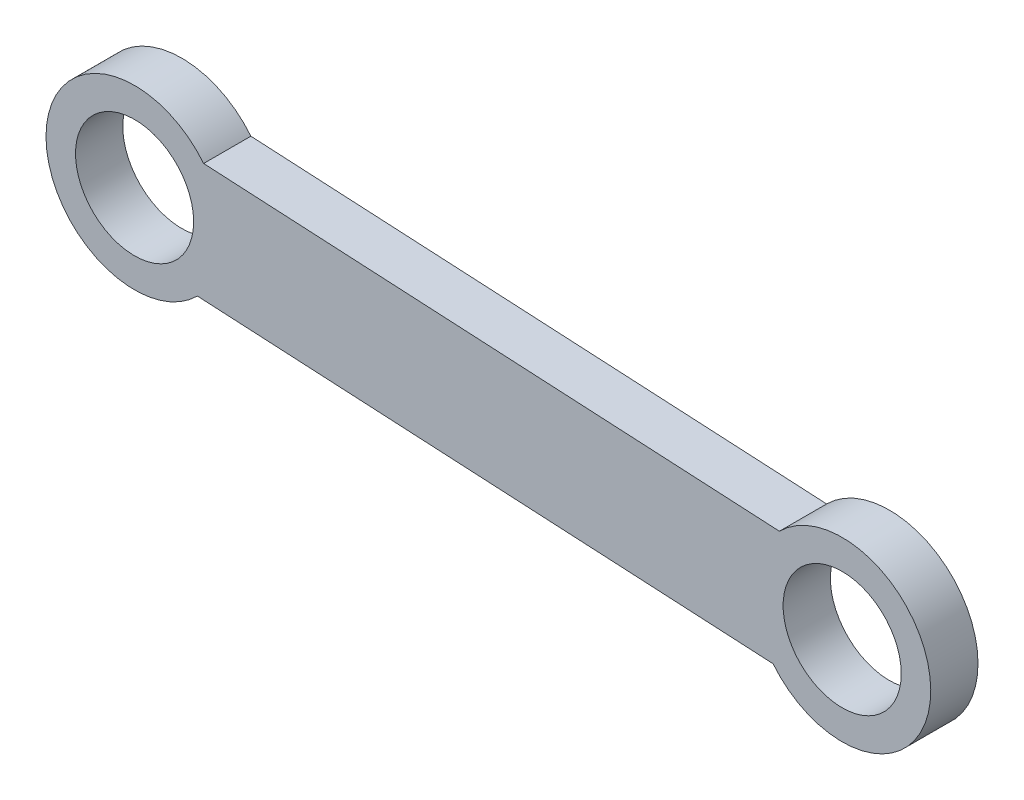
ISO-10303-21;
HEADER;
FILE_DESCRIPTION(('STEP AP214'),'2;1');
FILE_NAME('part.step','',(''),(''),'','','');
FILE_SCHEMA(('AUTOMOTIVE_DESIGN { 1 0 10303 214 1 1 1 1 }'));
ENDSEC;
DATA;
#1=APPLICATION_CONTEXT('core data for automotive mechanical design processes');
#2=APPLICATION_PROTOCOL_DEFINITION('international standard','automotive_design',2000,#1);
#3=PRODUCT_CONTEXT('',#1,'mechanical');
#4=PRODUCT('Part','Part','',(#3));
#5=PRODUCT_RELATED_PRODUCT_CATEGORY('part','',(#4));
#6=PRODUCT_DEFINITION_FORMATION('','',#4);
#7=PRODUCT_DEFINITION_CONTEXT('part definition',#1,'design');
#8=PRODUCT_DEFINITION('design','',#6,#7);
#9=PRODUCT_DEFINITION_SHAPE('','',#8);
#10=(LENGTH_UNIT() NAMED_UNIT(*) SI_UNIT(.MILLI.,.METRE.));
#11=(NAMED_UNIT(*) PLANE_ANGLE_UNIT() SI_UNIT($,.RADIAN.));
#12=(NAMED_UNIT(*) SI_UNIT($,.STERADIAN.) SOLID_ANGLE_UNIT());
#13=UNCERTAINTY_MEASURE_WITH_UNIT(LENGTH_MEASURE(1.E-05),#10,'distance_accuracy_value','');
#14=(GEOMETRIC_REPRESENTATION_CONTEXT(3) GLOBAL_UNCERTAINTY_ASSIGNED_CONTEXT((#13)) GLOBAL_UNIT_ASSIGNED_CONTEXT((#10,
#11,#12)) REPRESENTATION_CONTEXT('',''));
#15=CARTESIAN_POINT('',(0.,0.,0.));
#16=DIRECTION('',(0.,0.,1.));
#17=DIRECTION('',(1.,0.,0.));
#18=AXIS2_PLACEMENT_3D('',#15,#16,#17);
#19=CARTESIAN_POINT('',(-35.5373266073171,-8.81247047670461,4.));
#20=DIRECTION('',(0.,0.,-1.));
#21=DIRECTION('',(0.,1.,0.));
#22=AXIS2_PLACEMENT_3D('',#19,#20,#21);
#23=CYLINDRICAL_SURFACE('',#22,7.5);
#24=CARTESIAN_POINT('',(-35.5373266073171,-8.81247047670461,0.));
#25=DIRECTION('',(0.,0.,1.));
#26=DIRECTION('',(1.,0.,0.));
#27=AXIS2_PLACEMENT_3D('',#24,#25,#26);
#28=CIRCLE('',#27,7.5);
#29=CARTESIAN_POINT('',(-41.3850070361297,-13.5087065868764,0.));
#30=VERTEX_POINT('',#29);
#31=CARTESIAN_POINT('',(-40.8542258463999,-3.52280295582582,0.));
#32=VERTEX_POINT('',#31);
#33=EDGE_CURVE('E105',#30,#32,#28,.T.);
#34=ORIENTED_EDGE('',*,*,#33,.T.);
#35=DIRECTION('',(0.,0.,-1.));
#36=VECTOR('',#35,1.);
#37=CARTESIAN_POINT('',(-40.8542258463999,-3.52280295582582,4.));
#38=LINE('',#37,#36);
#39=CARTESIAN_POINT('',(-40.8542258463999,-3.52280295582582,4.));
#40=VERTEX_POINT('',#39);
#41=EDGE_CURVE('E11',#40,#32,#38,.T.);
#42=ORIENTED_EDGE('',*,*,#41,.F.);
#43=CARTESIAN_POINT('',(-35.5373266073171,-8.81247047670461,4.));
#44=DIRECTION('',(0.,0.,1.));
#45=DIRECTION('',(1.,0.,0.));
#46=AXIS2_PLACEMENT_3D('',#43,#44,#45);
#47=CIRCLE('',#46,7.5);
#48=CARTESIAN_POINT('',(-41.3850070361297,-13.5087065868764,4.));
#49=VERTEX_POINT('',#48);
#50=EDGE_CURVE('E85',#49,#40,#47,.T.);
#51=ORIENTED_EDGE('',*,*,#50,.F.);
#52=DIRECTION('',(0.,0.,-1.));
#53=VECTOR('',#52,1.);
#54=CARTESIAN_POINT('',(-41.3850070361297,-13.5087065868764,4.));
#55=LINE('',#54,#53);
#56=EDGE_CURVE('E51',#49,#30,#55,.T.);
#57=ORIENTED_EDGE('',*,*,#56,.T.);
#58=EDGE_LOOP('',(#34,#42,#51,#57));
#59=FACE_BOUND('',#58,.T.);
#60=ADVANCED_FACE('F35',(#59),#23,.T.);
#61=CARTESIAN_POINT('',(-0.301818242884665,-5.67828692096961,4.));
#62=DIRECTION('',(-0.0530781189729777,-0.998590363105057,0.));
#63=DIRECTION('',(0.998590363105057,-0.0530781189729777,0.));
#64=AXIS2_PLACEMENT_3D('',#61,#62,#63);
#65=PLANE('',#64);
#66=DIRECTION('',(-0.998590363105057,0.0530781189729777,0.));
#67=VECTOR('',#66,1.);
#68=CARTESIAN_POINT('',(-0.301818242884665,-5.67828692096961,0.));
#69=LINE('',#68,#67);
#70=CARTESIAN_POINT('',(-89.6050679648078,-0.931547228154151,0.));
#71=VERTEX_POINT('',#70);
#72=EDGE_CURVE('E90',#32,#71,#69,.T.);
#73=ORIENTED_EDGE('',*,*,#72,.T.);
#74=DIRECTION('',(0.,0.,-1.));
#75=VECTOR('',#74,1.);
#76=CARTESIAN_POINT('',(-89.6050679648078,-0.931547228154152,4.));
#77=LINE('',#76,#75);
#78=CARTESIAN_POINT('',(-89.6050679648078,-0.931547228154152,4.));
#79=VERTEX_POINT('',#78);
#80=EDGE_CURVE('E43',#79,#71,#77,.T.);
#81=ORIENTED_EDGE('',*,*,#80,.F.);
#82=DIRECTION('',(-0.998590363105057,0.0530781189729777,0.));
#83=VECTOR('',#82,1.);
#84=CARTESIAN_POINT('',(-0.301818242884665,-5.67828692096961,4.));
#85=LINE('',#84,#83);
#86=EDGE_CURVE('E77',#40,#79,#85,.T.);
#87=ORIENTED_EDGE('',*,*,#86,.F.);
#88=ORIENTED_EDGE('',*,*,#41,.T.);
#89=EDGE_LOOP('',(#73,#81,#87,#88));
#90=FACE_BOUND('',#89,.T.);
#91=ADVANCED_FACE('F89',(#90),#65,.F.);
#92=CARTESIAN_POINT('',(-95.4527483936205,-5.62778333832593,4.));
#93=DIRECTION('',(0.,0.,-1.));
#94=DIRECTION('',(0.,1.,0.));
#95=AXIS2_PLACEMENT_3D('',#92,#93,#94);
#96=CYLINDRICAL_SURFACE('',#95,7.5);
#97=CARTESIAN_POINT('',(-95.4527483936205,-5.62778333832593,0.));
#98=DIRECTION('',(0.,0.,1.));
#99=DIRECTION('',(1.,0.,0.));
#100=AXIS2_PLACEMENT_3D('',#97,#98,#99);
#101=CIRCLE('',#100,7.5);
#102=CARTESIAN_POINT('',(-90.1358491545376,-10.9174508592047,0.));
#103=VERTEX_POINT('',#102);
#104=EDGE_CURVE('E108',#71,#103,#101,.T.);
#105=ORIENTED_EDGE('',*,*,#104,.T.);
#106=DIRECTION('',(0.,0.,-1.));
#107=VECTOR('',#106,1.);
#108=CARTESIAN_POINT('',(-90.1358491545376,-10.9174508592047,4.));
#109=LINE('',#108,#107);
#110=CARTESIAN_POINT('',(-90.1358491545376,-10.9174508592047,4.));
#111=VERTEX_POINT('',#110);
#112=EDGE_CURVE('E66',#111,#103,#109,.T.);
#113=ORIENTED_EDGE('',*,*,#112,.F.);
#114=CARTESIAN_POINT('',(-95.4527483936205,-5.62778333832593,4.));
#115=DIRECTION('',(0.,0.,1.));
#116=DIRECTION('',(1.,0.,0.));
#117=AXIS2_PLACEMENT_3D('',#114,#115,#116);
#118=CIRCLE('',#117,7.5);
#119=EDGE_CURVE('E84',#79,#111,#118,.T.);
#120=ORIENTED_EDGE('',*,*,#119,.F.);
#121=ORIENTED_EDGE('',*,*,#80,.T.);
#122=EDGE_LOOP('',(#105,#113,#120,#121));
#123=FACE_BOUND('',#122,.T.);
#124=ADVANCED_FACE('F93',(#123),#96,.T.);
#125=CARTESIAN_POINT('',(-95.4527483936205,-5.62778333832593,4.));
#126=DIRECTION('',(0.,0.,-1.));
#127=DIRECTION('',(0.,1.,0.));
#128=AXIS2_PLACEMENT_3D('',#125,#126,#127);
#129=CYLINDRICAL_SURFACE('',#128,5.);
#130=CARTESIAN_POINT('',(-95.4527483936205,-5.62778333832593,4.));
#131=DIRECTION('',(0.,0.,1.));
#132=DIRECTION('',(1.,0.,0.));
#133=AXIS2_PLACEMENT_3D('',#130,#131,#132);
#134=CIRCLE('',#133,5.);
#135=CARTESIAN_POINT('',(-90.4527483936205,-5.62778333832593,4.));
#136=VERTEX_POINT('',#135);
#137=EDGE_CURVE('E96',#136,#136,#134,.T.);
#138=ORIENTED_EDGE('',*,*,#137,.T.);
#139=EDGE_LOOP('',(#138));
#140=FACE_BOUND('',#139,.T.);
#141=CARTESIAN_POINT('',(-95.4527483936205,-5.62778333832593,0.));
#142=DIRECTION('',(0.,0.,1.));
#143=DIRECTION('',(1.,0.,0.));
#144=AXIS2_PLACEMENT_3D('',#141,#142,#143);
#145=CIRCLE('',#144,5.);
#146=CARTESIAN_POINT('',(-90.4527483936205,-5.62778333832593,0.));
#147=VERTEX_POINT('',#146);
#148=EDGE_CURVE('E113',#147,#147,#145,.T.);
#149=ORIENTED_EDGE('',*,*,#148,.F.);
#150=EDGE_LOOP('',(#149));
#151=FACE_BOUND('',#150,.T.);
#152=ADVANCED_FACE('F134',(#140,#151),#129,.F.);
#153=CARTESIAN_POINT('',(-0.832599432614448,-15.6641905520202,4.));
#154=DIRECTION('',(-0.053078118972978,-0.998590363105057,0.));
#155=DIRECTION('',(0.998590363105057,-0.053078118972978,0.));
#156=AXIS2_PLACEMENT_3D('',#153,#154,#155);
#157=PLANE('',#156);
#158=DIRECTION('',(-0.998590363105057,0.053078118972978,0.));
#159=VECTOR('',#158,1.);
#160=CARTESIAN_POINT('',(-0.832599432614448,-15.6641905520202,0.));
#161=LINE('',#160,#159);
#162=EDGE_CURVE('E110',#30,#103,#161,.T.);
#163=ORIENTED_EDGE('',*,*,#162,.F.);
#164=ORIENTED_EDGE('',*,*,#56,.F.);
#165=DIRECTION('',(-0.998590363105057,0.053078118972978,0.));
#166=VECTOR('',#165,1.);
#167=CARTESIAN_POINT('',(-0.832599432614448,-15.6641905520202,4.));
#168=LINE('',#167,#166);
#169=EDGE_CURVE('E94',#49,#111,#168,.T.);
#170=ORIENTED_EDGE('',*,*,#169,.T.);
#171=ORIENTED_EDGE('',*,*,#112,.T.);
#172=EDGE_LOOP('',(#163,#164,#170,#171));
#173=FACE_BOUND('',#172,.T.);
#174=ADVANCED_FACE('F126',(#173),#157,.T.);
#175=CARTESIAN_POINT('',(-35.5373266073171,-8.81247047670461,4.));
#176=DIRECTION('',(0.,0.,-1.));
#177=DIRECTION('',(0.,1.,0.));
#178=AXIS2_PLACEMENT_3D('',#175,#176,#177);
#179=CYLINDRICAL_SURFACE('',#178,5.);
#180=CARTESIAN_POINT('',(-35.5373266073171,-8.81247047670461,4.));
#181=DIRECTION('',(0.,0.,1.));
#182=DIRECTION('',(1.,0.,0.));
#183=AXIS2_PLACEMENT_3D('',#180,#181,#182);
#184=CIRCLE('',#183,5.);
#185=CARTESIAN_POINT('',(-30.5373266073171,-8.81247047670461,4.));
#186=VERTEX_POINT('',#185);
#187=EDGE_CURVE('E102',#186,#186,#184,.T.);
#188=ORIENTED_EDGE('',*,*,#187,.T.);
#189=EDGE_LOOP('',(#188));
#190=FACE_BOUND('',#189,.T.);
#191=CARTESIAN_POINT('',(-35.5373266073171,-8.81247047670461,0.));
#192=DIRECTION('',(0.,0.,1.));
#193=DIRECTION('',(1.,0.,0.));
#194=AXIS2_PLACEMENT_3D('',#191,#192,#193);
#195=CIRCLE('',#194,5.);
#196=CARTESIAN_POINT('',(-30.5373266073171,-8.81247047670461,0.));
#197=VERTEX_POINT('',#196);
#198=EDGE_CURVE('E116',#197,#197,#195,.T.);
#199=ORIENTED_EDGE('',*,*,#198,.F.);
#200=EDGE_LOOP('',(#199));
#201=FACE_BOUND('',#200,.T.);
#202=ADVANCED_FACE('F124',(#190,#201),#179,.F.);
#203=CARTESIAN_POINT('',(0.,0.,4.));
#204=DIRECTION('',(0.,0.,1.));
#205=DIRECTION('',(1.,0.,0.));
#206=AXIS2_PLACEMENT_3D('',#203,#204,#205);
#207=PLANE('',#206);
#208=ORIENTED_EDGE('',*,*,#50,.T.);
#209=ORIENTED_EDGE('',*,*,#86,.T.);
#210=ORIENTED_EDGE('',*,*,#119,.T.);
#211=ORIENTED_EDGE('',*,*,#169,.F.);
#212=EDGE_LOOP('',(#208,#209,#210,#211));
#213=FACE_BOUND('',#212,.T.);
#214=ORIENTED_EDGE('',*,*,#137,.F.);
#215=EDGE_LOOP('',(#214));
#216=FACE_BOUND('',#215,.T.);
#217=ORIENTED_EDGE('',*,*,#187,.F.);
#218=EDGE_LOOP('',(#217));
#219=FACE_BOUND('',#218,.T.);
#220=ADVANCED_FACE('F80',(#213,#216,#219),#207,.T.);
#221=CARTESIAN_POINT('',(0.,0.,0.));
#222=DIRECTION('',(0.,0.,1.));
#223=DIRECTION('',(1.,0.,0.));
#224=AXIS2_PLACEMENT_3D('',#221,#222,#223);
#225=PLANE('',#224);
#226=ORIENTED_EDGE('',*,*,#33,.F.);
#227=ORIENTED_EDGE('',*,*,#162,.T.);
#228=ORIENTED_EDGE('',*,*,#104,.F.);
#229=ORIENTED_EDGE('',*,*,#72,.F.);
#230=EDGE_LOOP('',(#226,#227,#228,#229));
#231=FACE_BOUND('',#230,.T.);
#232=ORIENTED_EDGE('',*,*,#148,.T.);
#233=EDGE_LOOP('',(#232));
#234=FACE_BOUND('',#233,.T.);
#235=ORIENTED_EDGE('',*,*,#198,.T.);
#236=EDGE_LOOP('',(#235));
#237=FACE_BOUND('',#236,.T.);
#238=ADVANCED_FACE('F122',(#231,#234,#237),#225,.F.);
#239=CLOSED_SHELL('',(#60,#91,#124,#152,#174,#202,#220,#238));
#240=MANIFOLD_SOLID_BREP('B2',#239);
#241=ADVANCED_BREP_SHAPE_REPRESENTATION('',(#18,#240),#14);
#242=SHAPE_DEFINITION_REPRESENTATION(#9,#241);
ENDSEC;
END-ISO-10303-21;
